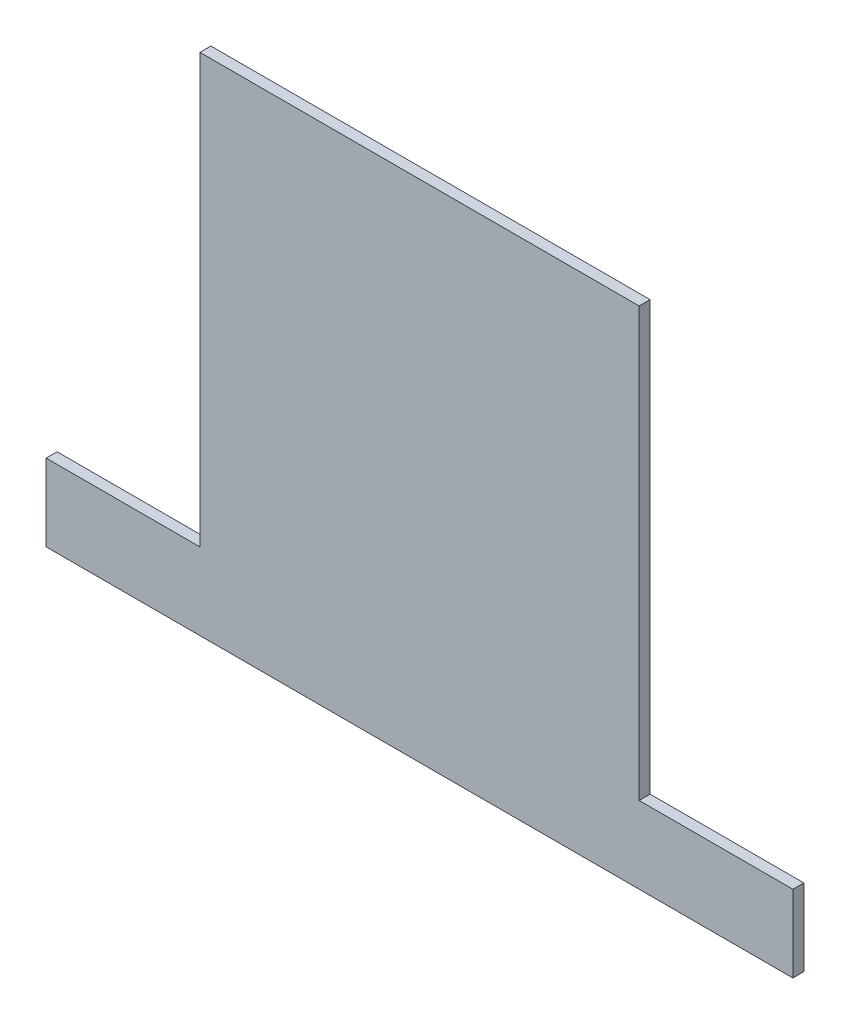
ISO-10303-21;
HEADER;
FILE_DESCRIPTION(('STEP AP214'),'2;1');
FILE_NAME('part.step','',(''),(''),'','','');
FILE_SCHEMA(('AUTOMOTIVE_DESIGN { 1 0 10303 214 1 1 1 1 }'));
ENDSEC;
DATA;
#1=APPLICATION_CONTEXT('core data for automotive mechanical design processes');
#2=APPLICATION_PROTOCOL_DEFINITION('international standard','automotive_design',2000,#1);
#3=PRODUCT_CONTEXT('',#1,'mechanical');
#4=PRODUCT('Part','Part','',(#3));
#5=PRODUCT_RELATED_PRODUCT_CATEGORY('part','',(#4));
#6=PRODUCT_DEFINITION_FORMATION('','',#4);
#7=PRODUCT_DEFINITION_CONTEXT('part definition',#1,'design');
#8=PRODUCT_DEFINITION('design','',#6,#7);
#9=PRODUCT_DEFINITION_SHAPE('','',#8);
#10=(LENGTH_UNIT() NAMED_UNIT(*) SI_UNIT(.MILLI.,.METRE.));
#11=(NAMED_UNIT(*) PLANE_ANGLE_UNIT() SI_UNIT($,.RADIAN.));
#12=(NAMED_UNIT(*) SI_UNIT($,.STERADIAN.) SOLID_ANGLE_UNIT());
#13=UNCERTAINTY_MEASURE_WITH_UNIT(LENGTH_MEASURE(1.E-05),#10,'distance_accuracy_value','');
#14=(GEOMETRIC_REPRESENTATION_CONTEXT(3) GLOBAL_UNCERTAINTY_ASSIGNED_CONTEXT((#13)) GLOBAL_UNIT_ASSIGNED_CONTEXT((#10,
#11,#12)) REPRESENTATION_CONTEXT('',''));
#15=CARTESIAN_POINT('',(0.,0.,0.));
#16=DIRECTION('',(0.,0.,1.));
#17=DIRECTION('',(1.,0.,0.));
#18=AXIS2_PLACEMENT_3D('',#15,#16,#17);
#19=CARTESIAN_POINT('',(0.,0.,6.35));
#20=DIRECTION('',(1.,0.,0.));
#21=DIRECTION('',(0.,0.,-1.));
#22=AXIS2_PLACEMENT_3D('',#19,#20,#21);
#23=PLANE('',#22);
#24=DIRECTION('',(0.,-1.,0.));
#25=VECTOR('',#24,1.);
#26=CARTESIAN_POINT('',(0.,0.,6.35));
#27=LINE('',#26,#25);
#28=CARTESIAN_POINT('',(0.,44.45,6.35));
#29=VERTEX_POINT('',#28);
#30=CARTESIAN_POINT('',(0.,0.,6.35));
#31=VERTEX_POINT('',#30);
#32=EDGE_CURVE('E117',#29,#31,#27,.T.);
#33=ORIENTED_EDGE('',*,*,#32,.F.);
#34=DIRECTION('',(0.,0.,1.));
#35=VECTOR('',#34,1.);
#36=CARTESIAN_POINT('',(0.,44.45,0.));
#37=LINE('',#36,#35);
#38=CARTESIAN_POINT('',(0.,44.45,0.));
#39=VERTEX_POINT('',#38);
#40=EDGE_CURVE('E158',#39,#29,#37,.T.);
#41=ORIENTED_EDGE('',*,*,#40,.F.);
#42=DIRECTION('',(0.,-1.,0.));
#43=VECTOR('',#42,1.);
#44=CARTESIAN_POINT('',(0.,0.,0.));
#45=LINE('',#44,#43);
#46=CARTESIAN_POINT('',(0.,0.,0.));
#47=VERTEX_POINT('',#46);
#48=EDGE_CURVE('E140',#39,#47,#45,.T.);
#49=ORIENTED_EDGE('',*,*,#48,.T.);
#50=DIRECTION('',(0.,0.,-1.));
#51=VECTOR('',#50,1.);
#52=CARTESIAN_POINT('',(0.,0.,6.35));
#53=LINE('',#52,#51);
#54=EDGE_CURVE('E11',#31,#47,#53,.T.);
#55=ORIENTED_EDGE('',*,*,#54,.F.);
#56=EDGE_LOOP('',(#33,#41,#49,#55));
#57=FACE_BOUND('',#56,.T.);
#58=ADVANCED_FACE('F33',(#57),#23,.F.);
#59=CARTESIAN_POINT('',(0.,0.,6.35));
#60=DIRECTION('',(0.,1.,0.));
#61=DIRECTION('',(0.,0.,1.));
#62=AXIS2_PLACEMENT_3D('',#59,#60,#61);
#63=PLANE('',#62);
#64=DIRECTION('',(1.,0.,0.));
#65=VECTOR('',#64,1.);
#66=CARTESIAN_POINT('',(0.,0.,0.));
#67=LINE('',#66,#65);
#68=CARTESIAN_POINT('',(431.8,0.,0.));
#69=VERTEX_POINT('',#68);
#70=EDGE_CURVE('E123',#47,#69,#67,.T.);
#71=ORIENTED_EDGE('',*,*,#70,.T.);
#72=DIRECTION('',(0.,0.,-1.));
#73=VECTOR('',#72,1.);
#74=CARTESIAN_POINT('',(431.8,0.,6.35));
#75=LINE('',#74,#73);
#76=CARTESIAN_POINT('',(431.8,0.,6.35));
#77=VERTEX_POINT('',#76);
#78=EDGE_CURVE('E40',#77,#69,#75,.T.);
#79=ORIENTED_EDGE('',*,*,#78,.F.);
#80=DIRECTION('',(1.,0.,0.));
#81=VECTOR('',#80,1.);
#82=CARTESIAN_POINT('',(0.,0.,6.35));
#83=LINE('',#82,#81);
#84=EDGE_CURVE('E120',#31,#77,#83,.T.);
#85=ORIENTED_EDGE('',*,*,#84,.F.);
#86=ORIENTED_EDGE('',*,*,#54,.T.);
#87=EDGE_LOOP('',(#71,#79,#85,#86));
#88=FACE_BOUND('',#87,.T.);
#89=ADVANCED_FACE('F144',(#88),#63,.F.);
#90=CARTESIAN_POINT('',(431.8,0.,6.35));
#91=DIRECTION('',(-1.,0.,0.));
#92=DIRECTION('',(0.,0.,1.));
#93=AXIS2_PLACEMENT_3D('',#90,#91,#92);
#94=PLANE('',#93);
#95=DIRECTION('',(0.,1.,0.));
#96=VECTOR('',#95,1.);
#97=CARTESIAN_POINT('',(431.8,0.,0.));
#98=LINE('',#97,#96);
#99=CARTESIAN_POINT('',(431.8,44.45,0.));
#100=VERTEX_POINT('',#99);
#101=EDGE_CURVE('E118',#69,#100,#98,.T.);
#102=ORIENTED_EDGE('',*,*,#101,.T.);
#103=DIRECTION('',(0.,0.,1.));
#104=VECTOR('',#103,1.);
#105=CARTESIAN_POINT('',(431.8,44.45,0.));
#106=LINE('',#105,#104);
#107=CARTESIAN_POINT('',(431.8,44.45,6.35));
#108=VERTEX_POINT('',#107);
#109=EDGE_CURVE('E150',#100,#108,#106,.T.);
#110=ORIENTED_EDGE('',*,*,#109,.T.);
#111=DIRECTION('',(0.,1.,0.));
#112=VECTOR('',#111,1.);
#113=CARTESIAN_POINT('',(431.8,0.,6.35));
#114=LINE('',#113,#112);
#115=EDGE_CURVE('E131',#77,#108,#114,.T.);
#116=ORIENTED_EDGE('',*,*,#115,.F.);
#117=ORIENTED_EDGE('',*,*,#78,.T.);
#118=EDGE_LOOP('',(#102,#110,#116,#117));
#119=FACE_BOUND('',#118,.T.);
#120=ADVANCED_FACE('F149',(#119),#94,.F.);
#121=CARTESIAN_POINT('',(0.,292.1,6.35));
#122=DIRECTION('',(0.,-1.,0.));
#123=DIRECTION('',(0.,0.,-1.));
#124=AXIS2_PLACEMENT_3D('',#121,#122,#123);
#125=PLANE('',#124);
#126=DIRECTION('',(-1.,0.,0.));
#127=VECTOR('',#126,1.);
#128=CARTESIAN_POINT('',(0.,292.1,6.35));
#129=LINE('',#128,#127);
#130=CARTESIAN_POINT('',(342.9,292.1,6.35));
#131=VERTEX_POINT('',#130);
#132=CARTESIAN_POINT('',(88.9,292.1,6.35));
#133=VERTEX_POINT('',#132);
#134=EDGE_CURVE('E113',#131,#133,#129,.T.);
#135=ORIENTED_EDGE('',*,*,#134,.F.);
#136=DIRECTION('',(0.,0.,1.));
#137=VECTOR('',#136,1.);
#138=CARTESIAN_POINT('',(342.9,292.1,0.));
#139=LINE('',#138,#137);
#140=CARTESIAN_POINT('',(342.9,292.1,0.));
#141=VERTEX_POINT('',#140);
#142=EDGE_CURVE('E101',#141,#131,#139,.T.);
#143=ORIENTED_EDGE('',*,*,#142,.F.);
#144=DIRECTION('',(-1.,0.,0.));
#145=VECTOR('',#144,1.);
#146=CARTESIAN_POINT('',(0.,292.1,0.));
#147=LINE('',#146,#145);
#148=CARTESIAN_POINT('',(88.9,292.1,0.));
#149=VERTEX_POINT('',#148);
#150=EDGE_CURVE('E112',#141,#149,#147,.T.);
#151=ORIENTED_EDGE('',*,*,#150,.T.);
#152=DIRECTION('',(0.,0.,1.));
#153=VECTOR('',#152,1.);
#154=CARTESIAN_POINT('',(88.9,292.1,0.));
#155=LINE('',#154,#153);
#156=EDGE_CURVE('E141',#149,#133,#155,.T.);
#157=ORIENTED_EDGE('',*,*,#156,.T.);
#158=EDGE_LOOP('',(#135,#143,#151,#157));
#159=FACE_BOUND('',#158,.T.);
#160=ADVANCED_FACE('F110',(#159),#125,.F.);
#161=CARTESIAN_POINT('',(0.,0.,6.35));
#162=DIRECTION('',(0.,0.,-1.));
#163=DIRECTION('',(-1.,0.,0.));
#164=AXIS2_PLACEMENT_3D('',#161,#162,#163);
#165=PLANE('',#164);
#166=ORIENTED_EDGE('',*,*,#115,.T.);
#167=DIRECTION('',(1.,0.,0.));
#168=VECTOR('',#167,1.);
#169=CARTESIAN_POINT('',(431.8,44.45,6.35));
#170=LINE('',#169,#168);
#171=CARTESIAN_POINT('',(342.9,44.45,6.35));
#172=VERTEX_POINT('',#171);
#173=EDGE_CURVE('E106',#172,#108,#170,.T.);
#174=ORIENTED_EDGE('',*,*,#173,.F.);
#175=DIRECTION('',(0.,-1.,0.));
#176=VECTOR('',#175,1.);
#177=CARTESIAN_POINT('',(342.9,44.45,6.35));
#178=LINE('',#177,#176);
#179=EDGE_CURVE('E172',#131,#172,#178,.T.);
#180=ORIENTED_EDGE('',*,*,#179,.F.);
#181=ORIENTED_EDGE('',*,*,#134,.T.);
#182=DIRECTION('',(0.,1.,0.));
#183=VECTOR('',#182,1.);
#184=CARTESIAN_POINT('',(88.9,292.1,6.35));
#185=LINE('',#184,#183);
#186=CARTESIAN_POINT('',(88.9,44.45,6.35));
#187=VERTEX_POINT('',#186);
#188=EDGE_CURVE('E163',#187,#133,#185,.T.);
#189=ORIENTED_EDGE('',*,*,#188,.F.);
#190=DIRECTION('',(1.,0.,0.));
#191=VECTOR('',#190,1.);
#192=CARTESIAN_POINT('',(0.,44.45,6.35));
#193=LINE('',#192,#191);
#194=EDGE_CURVE('E151',#29,#187,#193,.T.);
#195=ORIENTED_EDGE('',*,*,#194,.F.);
#196=ORIENTED_EDGE('',*,*,#32,.T.);
#197=ORIENTED_EDGE('',*,*,#84,.T.);
#198=EDGE_LOOP('',(#166,#174,#180,#181,#189,#195,#196,#197));
#199=FACE_BOUND('',#198,.T.);
#200=ADVANCED_FACE('F154',(#199),#165,.F.);
#201=CARTESIAN_POINT('',(0.,0.,0.));
#202=DIRECTION('',(0.,0.,-1.));
#203=DIRECTION('',(-1.,0.,0.));
#204=AXIS2_PLACEMENT_3D('',#201,#202,#203);
#205=PLANE('',#204);
#206=DIRECTION('',(1.,0.,0.));
#207=VECTOR('',#206,1.);
#208=CARTESIAN_POINT('',(431.8,44.45,0.));
#209=LINE('',#208,#207);
#210=CARTESIAN_POINT('',(342.9,44.45,0.));
#211=VERTEX_POINT('',#210);
#212=EDGE_CURVE('E47',#211,#100,#209,.T.);
#213=ORIENTED_EDGE('',*,*,#212,.T.);
#214=ORIENTED_EDGE('',*,*,#101,.F.);
#215=ORIENTED_EDGE('',*,*,#70,.F.);
#216=ORIENTED_EDGE('',*,*,#48,.F.);
#217=DIRECTION('',(1.,0.,0.));
#218=VECTOR('',#217,1.);
#219=CARTESIAN_POINT('',(0.,44.45,0.));
#220=LINE('',#219,#218);
#221=CARTESIAN_POINT('',(88.9,44.45,0.));
#222=VERTEX_POINT('',#221);
#223=EDGE_CURVE('E165',#39,#222,#220,.T.);
#224=ORIENTED_EDGE('',*,*,#223,.T.);
#225=DIRECTION('',(0.,1.,0.));
#226=VECTOR('',#225,1.);
#227=CARTESIAN_POINT('',(88.9,292.1,0.));
#228=LINE('',#227,#226);
#229=EDGE_CURVE('E55',#222,#149,#228,.T.);
#230=ORIENTED_EDGE('',*,*,#229,.T.);
#231=ORIENTED_EDGE('',*,*,#150,.F.);
#232=DIRECTION('',(0.,-1.,0.));
#233=VECTOR('',#232,1.);
#234=CARTESIAN_POINT('',(342.9,44.45,0.));
#235=LINE('',#234,#233);
#236=EDGE_CURVE('E97',#141,#211,#235,.T.);
#237=ORIENTED_EDGE('',*,*,#236,.T.);
#238=EDGE_LOOP('',(#213,#214,#215,#216,#224,#230,#231,#237));
#239=FACE_BOUND('',#238,.T.);
#240=ADVANCED_FACE('F115',(#239),#205,.T.);
#241=CARTESIAN_POINT('',(88.9,292.1,0.));
#242=DIRECTION('',(1.,0.,0.));
#243=DIRECTION('',(0.,0.,-1.));
#244=AXIS2_PLACEMENT_3D('',#241,#242,#243);
#245=PLANE('',#244);
#246=ORIENTED_EDGE('',*,*,#188,.T.);
#247=ORIENTED_EDGE('',*,*,#156,.F.);
#248=ORIENTED_EDGE('',*,*,#229,.F.);
#249=DIRECTION('',(0.,0.,1.));
#250=VECTOR('',#249,1.);
#251=CARTESIAN_POINT('',(88.9,44.45,0.));
#252=LINE('',#251,#250);
#253=EDGE_CURVE('E160',#222,#187,#252,.T.);
#254=ORIENTED_EDGE('',*,*,#253,.T.);
#255=EDGE_LOOP('',(#246,#247,#248,#254));
#256=FACE_BOUND('',#255,.T.);
#257=ADVANCED_FACE('F183',(#256),#245,.F.);
#258=CARTESIAN_POINT('',(0.,44.45,0.));
#259=DIRECTION('',(0.,-1.,0.));
#260=DIRECTION('',(0.,0.,-1.));
#261=AXIS2_PLACEMENT_3D('',#258,#259,#260);
#262=PLANE('',#261);
#263=ORIENTED_EDGE('',*,*,#194,.T.);
#264=ORIENTED_EDGE('',*,*,#253,.F.);
#265=ORIENTED_EDGE('',*,*,#223,.F.);
#266=ORIENTED_EDGE('',*,*,#40,.T.);
#267=EDGE_LOOP('',(#263,#264,#265,#266));
#268=FACE_BOUND('',#267,.T.);
#269=ADVANCED_FACE('F176',(#268),#262,.F.);
#270=CARTESIAN_POINT('',(431.8,44.45,0.));
#271=DIRECTION('',(0.,-1.,0.));
#272=DIRECTION('',(0.,0.,-1.));
#273=AXIS2_PLACEMENT_3D('',#270,#271,#272);
#274=PLANE('',#273);
#275=ORIENTED_EDGE('',*,*,#173,.T.);
#276=ORIENTED_EDGE('',*,*,#109,.F.);
#277=ORIENTED_EDGE('',*,*,#212,.F.);
#278=DIRECTION('',(0.,0.,1.));
#279=VECTOR('',#278,1.);
#280=CARTESIAN_POINT('',(342.9,44.45,0.));
#281=LINE('',#280,#279);
#282=EDGE_CURVE('E103',#211,#172,#281,.T.);
#283=ORIENTED_EDGE('',*,*,#282,.T.);
#284=EDGE_LOOP('',(#275,#276,#277,#283));
#285=FACE_BOUND('',#284,.T.);
#286=ADVANCED_FACE('F174',(#285),#274,.F.);
#287=CARTESIAN_POINT('',(342.9,44.45,0.));
#288=DIRECTION('',(-1.,0.,0.));
#289=DIRECTION('',(0.,0.,1.));
#290=AXIS2_PLACEMENT_3D('',#287,#288,#289);
#291=PLANE('',#290);
#292=ORIENTED_EDGE('',*,*,#179,.T.);
#293=ORIENTED_EDGE('',*,*,#282,.F.);
#294=ORIENTED_EDGE('',*,*,#236,.F.);
#295=ORIENTED_EDGE('',*,*,#142,.T.);
#296=EDGE_LOOP('',(#292,#293,#294,#295));
#297=FACE_BOUND('',#296,.T.);
#298=ADVANCED_FACE('F100',(#297),#291,.F.);
#299=CLOSED_SHELL('',(#58,#89,#120,#160,#200,#240,#257,#269,#286,#298));
#300=MANIFOLD_SOLID_BREP('B2',#299);
#301=ADVANCED_BREP_SHAPE_REPRESENTATION('',(#18,#300),#14);
#302=SHAPE_DEFINITION_REPRESENTATION(#9,#301);
ENDSEC;
END-ISO-10303-21;
